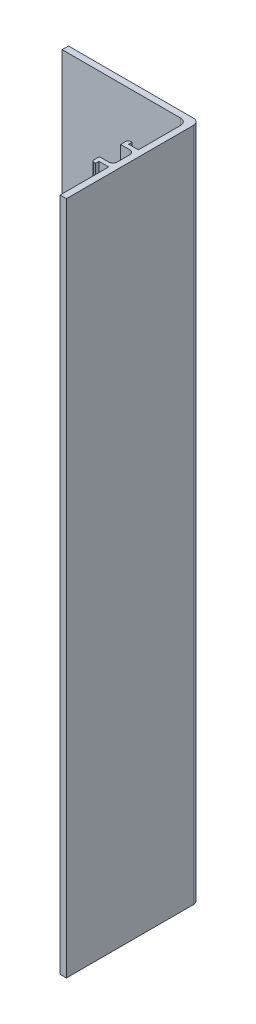
ISO-10303-21;
HEADER;
FILE_DESCRIPTION(('STEP AP214'),'2;1');
FILE_NAME('part.step','',(''),(''),'','','');
FILE_SCHEMA(('AUTOMOTIVE_DESIGN { 1 0 10303 214 1 1 1 1 }'));
ENDSEC;
DATA;
#1=APPLICATION_CONTEXT('core data for automotive mechanical design processes');
#2=APPLICATION_PROTOCOL_DEFINITION('international standard','automotive_design',2000,#1);
#3=PRODUCT_CONTEXT('',#1,'mechanical');
#4=PRODUCT('Part','Part','',(#3));
#5=PRODUCT_RELATED_PRODUCT_CATEGORY('part','',(#4));
#6=PRODUCT_DEFINITION_FORMATION('','',#4);
#7=PRODUCT_DEFINITION_CONTEXT('part definition',#1,'design');
#8=PRODUCT_DEFINITION('design','',#6,#7);
#9=PRODUCT_DEFINITION_SHAPE('','',#8);
#10=(LENGTH_UNIT() NAMED_UNIT(*) SI_UNIT(.MILLI.,.METRE.));
#11=(NAMED_UNIT(*) PLANE_ANGLE_UNIT() SI_UNIT($,.RADIAN.));
#12=(NAMED_UNIT(*) SI_UNIT($,.STERADIAN.) SOLID_ANGLE_UNIT());
#13=UNCERTAINTY_MEASURE_WITH_UNIT(LENGTH_MEASURE(1.E-05),#10,'distance_accuracy_value','');
#14=(GEOMETRIC_REPRESENTATION_CONTEXT(3) GLOBAL_UNCERTAINTY_ASSIGNED_CONTEXT((#13)) GLOBAL_UNIT_ASSIGNED_CONTEXT((#10,
#11,#12)) REPRESENTATION_CONTEXT('',''));
#15=CARTESIAN_POINT('',(0.,0.,0.));
#16=DIRECTION('',(0.,0.,1.));
#17=DIRECTION('',(1.,0.,0.));
#18=AXIS2_PLACEMENT_3D('',#15,#16,#17);
#19=CARTESIAN_POINT('',(-1.5,159.5,0.));
#20=DIRECTION('',(0.,0.,-1.));
#21=DIRECTION('',(-1.,0.,0.));
#22=AXIS2_PLACEMENT_3D('',#19,#20,#21);
#23=PLANE('',#22);
#24=DIRECTION('',(1.,0.,0.));
#25=VECTOR('',#24,1.);
#26=CARTESIAN_POINT('',(-1.5,0.,0.));
#27=LINE('',#26,#25);
#28=CARTESIAN_POINT('',(-1.5,0.,0.));
#29=VERTEX_POINT('',#28);
#30=CARTESIAN_POINT('',(0.,0.,0.));
#31=VERTEX_POINT('',#30);
#32=EDGE_CURVE('E220',#29,#31,#27,.T.);
#33=ORIENTED_EDGE('',*,*,#32,.T.);
#34=DIRECTION('',(0.,-1.,0.));
#35=VECTOR('',#34,1.);
#36=CARTESIAN_POINT('',(0.,159.5,0.));
#37=LINE('',#36,#35);
#38=CARTESIAN_POINT('',(0.,159.5,0.));
#39=VERTEX_POINT('',#38);
#40=EDGE_CURVE('E201',#39,#31,#37,.T.);
#41=ORIENTED_EDGE('',*,*,#40,.F.);
#42=DIRECTION('',(1.,0.,0.));
#43=VECTOR('',#42,1.);
#44=CARTESIAN_POINT('',(-1.5,159.5,0.));
#45=LINE('',#44,#43);
#46=CARTESIAN_POINT('',(-1.5,159.5,0.));
#47=VERTEX_POINT('',#46);
#48=EDGE_CURVE('E207',#47,#39,#45,.T.);
#49=ORIENTED_EDGE('',*,*,#48,.F.);
#50=DIRECTION('',(0.,-1.,0.));
#51=VECTOR('',#50,1.);
#52=CARTESIAN_POINT('',(-1.5,159.5,0.));
#53=LINE('',#52,#51);
#54=EDGE_CURVE('E367',#47,#29,#53,.T.);
#55=ORIENTED_EDGE('',*,*,#54,.T.);
#56=EDGE_LOOP('',(#33,#41,#49,#55));
#57=FACE_BOUND('',#56,.T.);
#58=ADVANCED_FACE('F39',(#57),#23,.F.);
#59=CARTESIAN_POINT('',(0.,159.5,0.));
#60=DIRECTION('',(-1.,0.,0.));
#61=DIRECTION('',(0.,0.,1.));
#62=AXIS2_PLACEMENT_3D('',#59,#60,#61);
#63=PLANE('',#62);
#64=DIRECTION('',(0.,0.,-1.));
#65=VECTOR('',#64,1.);
#66=CARTESIAN_POINT('',(0.,0.,0.));
#67=LINE('',#66,#65);
#68=CARTESIAN_POINT('',(0.,0.,-30.));
#69=VERTEX_POINT('',#68);
#70=EDGE_CURVE('E313',#31,#69,#67,.T.);
#71=ORIENTED_EDGE('',*,*,#70,.T.);
#72=DIRECTION('',(0.,-1.,0.));
#73=VECTOR('',#72,1.);
#74=CARTESIAN_POINT('',(0.,159.5,-30.));
#75=LINE('',#74,#73);
#76=CARTESIAN_POINT('',(0.,159.5,-30.));
#77=VERTEX_POINT('',#76);
#78=EDGE_CURVE('E48',#69,#77,#75,.F.);
#79=ORIENTED_EDGE('',*,*,#78,.T.);
#80=DIRECTION('',(0.,0.,-1.));
#81=VECTOR('',#80,1.);
#82=CARTESIAN_POINT('',(0.,159.5,0.));
#83=LINE('',#82,#81);
#84=EDGE_CURVE('E197',#39,#77,#83,.T.);
#85=ORIENTED_EDGE('',*,*,#84,.F.);
#86=ORIENTED_EDGE('',*,*,#40,.T.);
#87=EDGE_LOOP('',(#71,#79,#85,#86));
#88=FACE_BOUND('',#87,.T.);
#89=ADVANCED_FACE('F199',(#88),#63,.F.);
#90=CARTESIAN_POINT('',(0.,159.5,-31.5));
#91=DIRECTION('',(0.,0.,1.));
#92=DIRECTION('',(1.,0.,0.));
#93=AXIS2_PLACEMENT_3D('',#90,#91,#92);
#94=PLANE('',#93);
#95=DIRECTION('',(-1.,0.,0.));
#96=VECTOR('',#95,1.);
#97=CARTESIAN_POINT('',(0.,159.5,-31.5));
#98=LINE('',#97,#96);
#99=CARTESIAN_POINT('',(-1.5,159.5,-31.5));
#100=VERTEX_POINT('',#99);
#101=CARTESIAN_POINT('',(-31.,159.5,-31.5));
#102=VERTEX_POINT('',#101);
#103=EDGE_CURVE('E206',#100,#102,#98,.T.);
#104=ORIENTED_EDGE('',*,*,#103,.F.);
#105=DIRECTION('',(0.,-1.,0.));
#106=VECTOR('',#105,1.);
#107=CARTESIAN_POINT('',(-1.5,159.5,-31.5));
#108=LINE('',#107,#106);
#109=CARTESIAN_POINT('',(-1.5,0.,-31.5));
#110=VERTEX_POINT('',#109);
#111=EDGE_CURVE('E295',#100,#110,#108,.T.);
#112=ORIENTED_EDGE('',*,*,#111,.T.);
#113=DIRECTION('',(-1.,0.,0.));
#114=VECTOR('',#113,1.);
#115=CARTESIAN_POINT('',(0.,0.,-31.5));
#116=LINE('',#115,#114);
#117=CARTESIAN_POINT('',(-31.,0.,-31.5));
#118=VERTEX_POINT('',#117);
#119=EDGE_CURVE('E306',#110,#118,#116,.T.);
#120=ORIENTED_EDGE('',*,*,#119,.T.);
#121=DIRECTION('',(0.,-1.,0.));
#122=VECTOR('',#121,1.);
#123=CARTESIAN_POINT('',(-31.,159.5,-31.5));
#124=LINE('',#123,#122);
#125=EDGE_CURVE('E223',#102,#118,#124,.T.);
#126=ORIENTED_EDGE('',*,*,#125,.F.);
#127=EDGE_LOOP('',(#104,#112,#120,#126));
#128=FACE_BOUND('',#127,.T.);
#129=ADVANCED_FACE('F304',(#128),#94,.F.);
#130=CARTESIAN_POINT('',(-31.,159.5,-31.5));
#131=DIRECTION('',(1.,0.,0.));
#132=DIRECTION('',(0.,0.,-1.));
#133=AXIS2_PLACEMENT_3D('',#130,#131,#132);
#134=PLANE('',#133);
#135=DIRECTION('',(0.,0.,1.));
#136=VECTOR('',#135,1.);
#137=CARTESIAN_POINT('',(-31.,0.,-31.5));
#138=LINE('',#137,#136);
#139=CARTESIAN_POINT('',(-31.,0.,-30.));
#140=VERTEX_POINT('',#139);
#141=EDGE_CURVE('E311',#118,#140,#138,.T.);
#142=ORIENTED_EDGE('',*,*,#141,.T.);
#143=DIRECTION('',(0.,-1.,0.));
#144=VECTOR('',#143,1.);
#145=CARTESIAN_POINT('',(-31.,159.5,-30.));
#146=LINE('',#145,#144);
#147=CARTESIAN_POINT('',(-31.,159.5,-30.));
#148=VERTEX_POINT('',#147);
#149=EDGE_CURVE('E231',#148,#140,#146,.T.);
#150=ORIENTED_EDGE('',*,*,#149,.F.);
#151=DIRECTION('',(0.,0.,1.));
#152=VECTOR('',#151,1.);
#153=CARTESIAN_POINT('',(-31.,159.5,-31.5));
#154=LINE('',#153,#152);
#155=EDGE_CURVE('E431',#102,#148,#154,.T.);
#156=ORIENTED_EDGE('',*,*,#155,.F.);
#157=ORIENTED_EDGE('',*,*,#125,.T.);
#158=EDGE_LOOP('',(#142,#150,#156,#157));
#159=FACE_BOUND('',#158,.T.);
#160=ADVANCED_FACE('F482',(#159),#134,.F.);
#161=CARTESIAN_POINT('',(-31.,159.5,-30.));
#162=DIRECTION('',(0.,0.,-1.));
#163=DIRECTION('',(-1.,0.,0.));
#164=AXIS2_PLACEMENT_3D('',#161,#162,#163);
#165=PLANE('',#164);
#166=DIRECTION('',(1.,0.,0.));
#167=VECTOR('',#166,1.);
#168=CARTESIAN_POINT('',(-31.,0.,-30.));
#169=LINE('',#168,#167);
#170=CARTESIAN_POINT('',(-3.,0.,-30.));
#171=VERTEX_POINT('',#170);
#172=EDGE_CURVE('E317',#140,#171,#169,.T.);
#173=ORIENTED_EDGE('',*,*,#172,.T.);
#174=DIRECTION('',(0.,-1.,0.));
#175=VECTOR('',#174,1.);
#176=CARTESIAN_POINT('',(-3.,159.5,-30.));
#177=LINE('',#176,#175);
#178=CARTESIAN_POINT('',(-3.,159.5,-30.));
#179=VERTEX_POINT('',#178);
#180=EDGE_CURVE('E286',#171,#179,#177,.F.);
#181=ORIENTED_EDGE('',*,*,#180,.T.);
#182=DIRECTION('',(1.,0.,0.));
#183=VECTOR('',#182,1.);
#184=CARTESIAN_POINT('',(-31.,159.5,-30.));
#185=LINE('',#184,#183);
#186=EDGE_CURVE('E409',#148,#179,#185,.T.);
#187=ORIENTED_EDGE('',*,*,#186,.F.);
#188=ORIENTED_EDGE('',*,*,#149,.T.);
#189=EDGE_LOOP('',(#173,#181,#187,#188));
#190=FACE_BOUND('',#189,.T.);
#191=ADVANCED_FACE('F406',(#190),#165,.F.);
#192=CARTESIAN_POINT('',(-1.5,159.5,-30.));
#193=DIRECTION('',(1.,0.,0.));
#194=DIRECTION('',(0.,0.,-1.));
#195=AXIS2_PLACEMENT_3D('',#192,#193,#194);
#196=PLANE('',#195);
#197=DIRECTION('',(0.,0.,1.));
#198=VECTOR('',#197,1.);
#199=CARTESIAN_POINT('',(-1.5,159.5,-30.));
#200=LINE('',#199,#198);
#201=CARTESIAN_POINT('',(-1.5,159.5,-28.5));
#202=VERTEX_POINT('',#201);
#203=CARTESIAN_POINT('',(-1.5,159.5,-18.5));
#204=VERTEX_POINT('',#203);
#205=EDGE_CURVE('E422',#202,#204,#200,.T.);
#206=ORIENTED_EDGE('',*,*,#205,.F.);
#207=DIRECTION('',(0.,-1.,0.));
#208=VECTOR('',#207,1.);
#209=CARTESIAN_POINT('',(-1.5,0.,-28.5));
#210=LINE('',#209,#208);
#211=CARTESIAN_POINT('',(-1.5,0.,-28.5));
#212=VERTEX_POINT('',#211);
#213=EDGE_CURVE('E282',#202,#212,#210,.T.);
#214=ORIENTED_EDGE('',*,*,#213,.T.);
#215=DIRECTION('',(0.,0.,1.));
#216=VECTOR('',#215,1.);
#217=CARTESIAN_POINT('',(-1.5,0.,-30.));
#218=LINE('',#217,#216);
#219=CARTESIAN_POINT('',(-1.5,0.,-18.5));
#220=VERTEX_POINT('',#219);
#221=EDGE_CURVE('E325',#212,#220,#218,.T.);
#222=ORIENTED_EDGE('',*,*,#221,.T.);
#223=DIRECTION('',(0.,-1.,0.));
#224=VECTOR('',#223,1.);
#225=CARTESIAN_POINT('',(-1.5,159.5,-18.5));
#226=LINE('',#225,#224);
#227=EDGE_CURVE('E398',#204,#220,#226,.T.);
#228=ORIENTED_EDGE('',*,*,#227,.F.);
#229=EDGE_LOOP('',(#206,#214,#222,#228));
#230=FACE_BOUND('',#229,.T.);
#231=ADVANCED_FACE('F420',(#230),#196,.F.);
#232=CARTESIAN_POINT('',(-1.5,159.5,-18.5));
#233=DIRECTION('',(0.,0.,1.));
#234=DIRECTION('',(1.,0.,0.));
#235=AXIS2_PLACEMENT_3D('',#232,#233,#234);
#236=PLANE('',#235);
#237=DIRECTION('',(-1.,0.,0.));
#238=VECTOR('',#237,1.);
#239=CARTESIAN_POINT('',(-1.5,0.,-18.5));
#240=LINE('',#239,#238);
#241=CARTESIAN_POINT('',(-3.8,0.,-18.5));
#242=VERTEX_POINT('',#241);
#243=EDGE_CURVE('E328',#220,#242,#240,.T.);
#244=ORIENTED_EDGE('',*,*,#243,.T.);
#245=DIRECTION('',(0.,-1.,0.));
#246=VECTOR('',#245,1.);
#247=CARTESIAN_POINT('',(-3.8,159.5,-18.5));
#248=LINE('',#247,#246);
#249=CARTESIAN_POINT('',(-3.8,159.5,-18.5));
#250=VERTEX_POINT('',#249);
#251=EDGE_CURVE('E394',#250,#242,#248,.T.);
#252=ORIENTED_EDGE('',*,*,#251,.F.);
#253=DIRECTION('',(-1.,0.,0.));
#254=VECTOR('',#253,1.);
#255=CARTESIAN_POINT('',(-1.5,159.5,-18.5));
#256=LINE('',#255,#254);
#257=EDGE_CURVE('E425',#204,#250,#256,.T.);
#258=ORIENTED_EDGE('',*,*,#257,.F.);
#259=ORIENTED_EDGE('',*,*,#227,.T.);
#260=EDGE_LOOP('',(#244,#252,#258,#259));
#261=FACE_BOUND('',#260,.T.);
#262=ADVANCED_FACE('F567',(#261),#236,.F.);
#263=CARTESIAN_POINT('',(-3.8,159.5,-18.5));
#264=DIRECTION('',(-1.,0.,0.));
#265=DIRECTION('',(0.,0.,1.));
#266=AXIS2_PLACEMENT_3D('',#263,#264,#265);
#267=PLANE('',#266);
#268=DIRECTION('',(0.,0.,-1.));
#269=VECTOR('',#268,1.);
#270=CARTESIAN_POINT('',(-3.8,0.,-18.5));
#271=LINE('',#270,#269);
#272=CARTESIAN_POINT('',(-3.8,0.,-19.3));
#273=VERTEX_POINT('',#272);
#274=EDGE_CURVE('E331',#242,#273,#271,.T.);
#275=ORIENTED_EDGE('',*,*,#274,.T.);
#276=DIRECTION('',(0.,-1.,0.));
#277=VECTOR('',#276,1.);
#278=CARTESIAN_POINT('',(-3.8,159.5,-19.3));
#279=LINE('',#278,#277);
#280=CARTESIAN_POINT('',(-3.8,159.5,-19.3));
#281=VERTEX_POINT('',#280);
#282=EDGE_CURVE('E390',#281,#273,#279,.T.);
#283=ORIENTED_EDGE('',*,*,#282,.F.);
#284=DIRECTION('',(0.,0.,-1.));
#285=VECTOR('',#284,1.);
#286=CARTESIAN_POINT('',(-3.8,159.5,-18.5));
#287=LINE('',#286,#285);
#288=EDGE_CURVE('E429',#250,#281,#287,.T.);
#289=ORIENTED_EDGE('',*,*,#288,.F.);
#290=ORIENTED_EDGE('',*,*,#251,.T.);
#291=EDGE_LOOP('',(#275,#283,#289,#290));
#292=FACE_BOUND('',#291,.T.);
#293=ADVANCED_FACE('F670',(#292),#267,.F.);
#294=CARTESIAN_POINT('',(-4.7,159.5,-19.3));
#295=DIRECTION('',(0.,0.,1.));
#296=DIRECTION('',(1.,0.,0.));
#297=AXIS2_PLACEMENT_3D('',#294,#295,#296);
#298=PLANE('',#297);
#299=DIRECTION('',(-1.,0.,0.));
#300=VECTOR('',#299,1.);
#301=CARTESIAN_POINT('',(-4.7,0.,-19.3));
#302=LINE('',#301,#300);
#303=CARTESIAN_POINT('',(-4.2,0.,-19.3));
#304=VERTEX_POINT('',#303);
#305=EDGE_CURVE('E334',#273,#304,#302,.T.);
#306=ORIENTED_EDGE('',*,*,#305,.T.);
#307=DIRECTION('',(0.,-1.,0.));
#308=VECTOR('',#307,1.);
#309=CARTESIAN_POINT('',(-4.2,159.5,-19.3));
#310=LINE('',#309,#308);
#311=CARTESIAN_POINT('',(-4.2,159.5,-19.3));
#312=VERTEX_POINT('',#311);
#313=EDGE_CURVE('E253',#304,#312,#310,.F.);
#314=ORIENTED_EDGE('',*,*,#313,.T.);
#315=DIRECTION('',(-1.,0.,0.));
#316=VECTOR('',#315,1.);
#317=CARTESIAN_POINT('',(-4.7,159.5,-19.3));
#318=LINE('',#317,#316);
#319=EDGE_CURVE('E437',#281,#312,#318,.T.);
#320=ORIENTED_EDGE('',*,*,#319,.F.);
#321=ORIENTED_EDGE('',*,*,#282,.T.);
#322=EDGE_LOOP('',(#306,#314,#320,#321));
#323=FACE_BOUND('',#322,.T.);
#324=ADVANCED_FACE('F660',(#323),#298,.F.);
#325=CARTESIAN_POINT('',(-4.7,159.5,-19.3));
#326=DIRECTION('',(1.,0.,0.));
#327=DIRECTION('',(0.,0.,-1.));
#328=AXIS2_PLACEMENT_3D('',#325,#326,#327);
#329=PLANE('',#328);
#330=DIRECTION('',(0.,0.,1.));
#331=VECTOR('',#330,1.);
#332=CARTESIAN_POINT('',(-4.7,159.5,-19.3));
#333=LINE('',#332,#331);
#334=CARTESIAN_POINT('',(-4.7,159.5,-18.8));
#335=VERTEX_POINT('',#334);
#336=CARTESIAN_POINT('',(-4.7,159.5,-17.5));
#337=VERTEX_POINT('',#336);
#338=EDGE_CURVE('E441',#335,#337,#333,.T.);
#339=ORIENTED_EDGE('',*,*,#338,.F.);
#340=DIRECTION('',(0.,-1.,0.));
#341=VECTOR('',#340,1.);
#342=CARTESIAN_POINT('',(-4.7,159.5,-18.8));
#343=LINE('',#342,#341);
#344=CARTESIAN_POINT('',(-4.7,0.,-18.8));
#345=VERTEX_POINT('',#344);
#346=EDGE_CURVE('E249',#335,#345,#343,.T.);
#347=ORIENTED_EDGE('',*,*,#346,.T.);
#348=DIRECTION('',(0.,0.,1.));
#349=VECTOR('',#348,1.);
#350=CARTESIAN_POINT('',(-4.7,0.,-19.3));
#351=LINE('',#350,#349);
#352=CARTESIAN_POINT('',(-4.7,0.,-17.5));
#353=VERTEX_POINT('',#352);
#354=EDGE_CURVE('E338',#345,#353,#351,.T.);
#355=ORIENTED_EDGE('',*,*,#354,.T.);
#356=DIRECTION('',(0.,-1.,0.));
#357=VECTOR('',#356,1.);
#358=CARTESIAN_POINT('',(-4.7,159.5,-17.5));
#359=LINE('',#358,#357);
#360=EDGE_CURVE('E386',#337,#353,#359,.T.);
#361=ORIENTED_EDGE('',*,*,#360,.F.);
#362=EDGE_LOOP('',(#339,#347,#355,#361));
#363=FACE_BOUND('',#362,.T.);
#364=ADVANCED_FACE('F620',(#363),#329,.F.);
#365=CARTESIAN_POINT('',(-4.7,159.5,-17.5));
#366=DIRECTION('',(0.,0.,-1.));
#367=DIRECTION('',(-1.,0.,0.));
#368=AXIS2_PLACEMENT_3D('',#365,#366,#367);
#369=PLANE('',#368);
#370=DIRECTION('',(1.,0.,0.));
#371=VECTOR('',#370,1.);
#372=CARTESIAN_POINT('',(-4.7,0.,-17.5));
#373=LINE('',#372,#371);
#374=CARTESIAN_POINT('',(-2.5,0.,-17.5));
#375=VERTEX_POINT('',#374);
#376=EDGE_CURVE('E341',#353,#375,#373,.T.);
#377=ORIENTED_EDGE('',*,*,#376,.T.);
#378=DIRECTION('',(0.,-1.,0.));
#379=VECTOR('',#378,1.);
#380=CARTESIAN_POINT('',(-2.5,159.5,-17.5));
#381=LINE('',#380,#379);
#382=CARTESIAN_POINT('',(-2.5,159.5,-17.5));
#383=VERTEX_POINT('',#382);
#384=EDGE_CURVE('E267',#375,#383,#381,.F.);
#385=ORIENTED_EDGE('',*,*,#384,.T.);
#386=DIRECTION('',(1.,0.,0.));
#387=VECTOR('',#386,1.);
#388=CARTESIAN_POINT('',(-4.7,159.5,-17.5));
#389=LINE('',#388,#387);
#390=EDGE_CURVE('E444',#337,#383,#389,.T.);
#391=ORIENTED_EDGE('',*,*,#390,.F.);
#392=ORIENTED_EDGE('',*,*,#360,.T.);
#393=EDGE_LOOP('',(#377,#385,#391,#392));
#394=FACE_BOUND('',#393,.T.);
#395=ADVANCED_FACE('F610',(#394),#369,.F.);
#396=CARTESIAN_POINT('',(-1.5,159.5,-17.5));
#397=DIRECTION('',(1.,0.,0.));
#398=DIRECTION('',(0.,0.,-1.));
#399=AXIS2_PLACEMENT_3D('',#396,#397,#398);
#400=PLANE('',#399);
#401=DIRECTION('',(0.,0.,1.));
#402=VECTOR('',#401,1.);
#403=CARTESIAN_POINT('',(-1.5,0.,-17.5));
#404=LINE('',#403,#402);
#405=CARTESIAN_POINT('',(-1.5,0.,-16.5));
#406=VERTEX_POINT('',#405);
#407=CARTESIAN_POINT('',(-1.5,0.,-13.5));
#408=VERTEX_POINT('',#407);
#409=EDGE_CURVE('E345',#406,#408,#404,.T.);
#410=ORIENTED_EDGE('',*,*,#409,.T.);
#411=DIRECTION('',(0.,-1.,0.));
#412=VECTOR('',#411,1.);
#413=CARTESIAN_POINT('',(-1.5,159.5,-13.5));
#414=LINE('',#413,#412);
#415=CARTESIAN_POINT('',(-1.5,159.5,-13.5));
#416=VERTEX_POINT('',#415);
#417=EDGE_CURVE('E264',#408,#416,#414,.F.);
#418=ORIENTED_EDGE('',*,*,#417,.T.);
#419=DIRECTION('',(0.,0.,1.));
#420=VECTOR('',#419,1.);
#421=CARTESIAN_POINT('',(-1.5,159.5,-17.5));
#422=LINE('',#421,#420);
#423=CARTESIAN_POINT('',(-1.5,159.5,-16.5));
#424=VERTEX_POINT('',#423);
#425=EDGE_CURVE('E448',#424,#416,#422,.T.);
#426=ORIENTED_EDGE('',*,*,#425,.F.);
#427=DIRECTION('',(0.,-1.,0.));
#428=VECTOR('',#427,1.);
#429=CARTESIAN_POINT('',(-1.5,0.,-16.5));
#430=LINE('',#429,#428);
#431=EDGE_CURVE('E260',#424,#406,#430,.T.);
#432=ORIENTED_EDGE('',*,*,#431,.T.);
#433=EDGE_LOOP('',(#410,#418,#426,#432));
#434=FACE_BOUND('',#433,.T.);
#435=ADVANCED_FACE('F598',(#434),#400,.F.);
#436=CARTESIAN_POINT('',(-1.5,159.5,-12.5));
#437=DIRECTION('',(0.,0.,1.));
#438=DIRECTION('',(1.,0.,0.));
#439=AXIS2_PLACEMENT_3D('',#436,#437,#438);
#440=PLANE('',#439);
#441=DIRECTION('',(-1.,0.,0.));
#442=VECTOR('',#441,1.);
#443=CARTESIAN_POINT('',(-1.5,159.5,-12.5));
#444=LINE('',#443,#442);
#445=CARTESIAN_POINT('',(-2.5,159.5,-12.5));
#446=VERTEX_POINT('',#445);
#447=CARTESIAN_POINT('',(-4.7,159.5,-12.5));
#448=VERTEX_POINT('',#447);
#449=EDGE_CURVE('E452',#446,#448,#444,.T.);
#450=ORIENTED_EDGE('',*,*,#449,.F.);
#451=DIRECTION('',(0.,-1.,0.));
#452=VECTOR('',#451,1.);
#453=CARTESIAN_POINT('',(-2.5,0.,-12.5));
#454=LINE('',#453,#452);
#455=CARTESIAN_POINT('',(-2.5,0.,-12.5));
#456=VERTEX_POINT('',#455);
#457=EDGE_CURVE('E256',#446,#456,#454,.T.);
#458=ORIENTED_EDGE('',*,*,#457,.T.);
#459=DIRECTION('',(-1.,0.,0.));
#460=VECTOR('',#459,1.);
#461=CARTESIAN_POINT('',(-1.5,0.,-12.5));
#462=LINE('',#461,#460);
#463=CARTESIAN_POINT('',(-4.7,0.,-12.5));
#464=VERTEX_POINT('',#463);
#465=EDGE_CURVE('E349',#456,#464,#462,.T.);
#466=ORIENTED_EDGE('',*,*,#465,.T.);
#467=DIRECTION('',(0.,-1.,0.));
#468=VECTOR('',#467,1.);
#469=CARTESIAN_POINT('',(-4.7,159.5,-12.5));
#470=LINE('',#469,#468);
#471=EDGE_CURVE('E382',#448,#464,#470,.T.);
#472=ORIENTED_EDGE('',*,*,#471,.F.);
#473=EDGE_LOOP('',(#450,#458,#466,#472));
#474=FACE_BOUND('',#473,.T.);
#475=ADVANCED_FACE('F592',(#474),#440,.F.);
#476=CARTESIAN_POINT('',(-4.7,159.5,-12.5));
#477=DIRECTION('',(1.,0.,0.));
#478=DIRECTION('',(0.,0.,-1.));
#479=AXIS2_PLACEMENT_3D('',#476,#477,#478);
#480=PLANE('',#479);
#481=DIRECTION('',(0.,0.,1.));
#482=VECTOR('',#481,1.);
#483=CARTESIAN_POINT('',(-4.7,0.,-12.5));
#484=LINE('',#483,#482);
#485=CARTESIAN_POINT('',(-4.7,0.,-11.2));
#486=VERTEX_POINT('',#485);
#487=EDGE_CURVE('E352',#464,#486,#484,.T.);
#488=ORIENTED_EDGE('',*,*,#487,.T.);
#489=DIRECTION('',(0.,-1.,0.));
#490=VECTOR('',#489,1.);
#491=CARTESIAN_POINT('',(-4.7,159.5,-11.2));
#492=LINE('',#491,#490);
#493=CARTESIAN_POINT('',(-4.7,159.5,-11.2));
#494=VERTEX_POINT('',#493);
#495=EDGE_CURVE('E240',#486,#494,#492,.F.);
#496=ORIENTED_EDGE('',*,*,#495,.T.);
#497=DIRECTION('',(0.,0.,1.));
#498=VECTOR('',#497,1.);
#499=CARTESIAN_POINT('',(-4.7,159.5,-12.5));
#500=LINE('',#499,#498);
#501=EDGE_CURVE('E455',#448,#494,#500,.T.);
#502=ORIENTED_EDGE('',*,*,#501,.F.);
#503=ORIENTED_EDGE('',*,*,#471,.T.);
#504=EDGE_LOOP('',(#488,#496,#502,#503));
#505=FACE_BOUND('',#504,.T.);
#506=ADVANCED_FACE('F597',(#505),#480,.F.);
#507=CARTESIAN_POINT('',(-4.7,159.5,-10.7));
#508=DIRECTION('',(0.,0.,-1.));
#509=DIRECTION('',(-1.,0.,0.));
#510=AXIS2_PLACEMENT_3D('',#507,#508,#509);
#511=PLANE('',#510);
#512=DIRECTION('',(1.,0.,0.));
#513=VECTOR('',#512,1.);
#514=CARTESIAN_POINT('',(-4.7,159.5,-10.7));
#515=LINE('',#514,#513);
#516=CARTESIAN_POINT('',(-4.2,159.5,-10.7));
#517=VERTEX_POINT('',#516);
#518=CARTESIAN_POINT('',(-3.8,159.5,-10.7));
#519=VERTEX_POINT('',#518);
#520=EDGE_CURVE('E459',#517,#519,#515,.T.);
#521=ORIENTED_EDGE('',*,*,#520,.F.);
#522=DIRECTION('',(0.,-1.,0.));
#523=VECTOR('',#522,1.);
#524=CARTESIAN_POINT('',(-4.2,159.5,-10.7));
#525=LINE('',#524,#523);
#526=CARTESIAN_POINT('',(-4.2,0.,-10.7));
#527=VERTEX_POINT('',#526);
#528=EDGE_CURVE('E222',#517,#527,#525,.T.);
#529=ORIENTED_EDGE('',*,*,#528,.T.);
#530=DIRECTION('',(1.,0.,0.));
#531=VECTOR('',#530,1.);
#532=CARTESIAN_POINT('',(-4.7,0.,-10.7));
#533=LINE('',#532,#531);
#534=CARTESIAN_POINT('',(-3.8,0.,-10.7));
#535=VERTEX_POINT('',#534);
#536=EDGE_CURVE('E356',#527,#535,#533,.T.);
#537=ORIENTED_EDGE('',*,*,#536,.T.);
#538=DIRECTION('',(0.,-1.,0.));
#539=VECTOR('',#538,1.);
#540=CARTESIAN_POINT('',(-3.8,159.5,-10.7));
#541=LINE('',#540,#539);
#542=EDGE_CURVE('E378',#519,#535,#541,.T.);
#543=ORIENTED_EDGE('',*,*,#542,.F.);
#544=EDGE_LOOP('',(#521,#529,#537,#543));
#545=FACE_BOUND('',#544,.T.);
#546=ADVANCED_FACE('F638',(#545),#511,.F.);
#547=CARTESIAN_POINT('',(-3.8,159.5,-11.5));
#548=DIRECTION('',(-1.,0.,0.));
#549=DIRECTION('',(0.,0.,1.));
#550=AXIS2_PLACEMENT_3D('',#547,#548,#549);
#551=PLANE('',#550);
#552=DIRECTION('',(0.,0.,-1.));
#553=VECTOR('',#552,1.);
#554=CARTESIAN_POINT('',(-3.8,0.,-11.5));
#555=LINE('',#554,#553);
#556=CARTESIAN_POINT('',(-3.8,0.,-11.5));
#557=VERTEX_POINT('',#556);
#558=EDGE_CURVE('E359',#535,#557,#555,.T.);
#559=ORIENTED_EDGE('',*,*,#558,.T.);
#560=DIRECTION('',(0.,-1.,0.));
#561=VECTOR('',#560,1.);
#562=CARTESIAN_POINT('',(-3.8,159.5,-11.5));
#563=LINE('',#562,#561);
#564=CARTESIAN_POINT('',(-3.8,159.5,-11.5));
#565=VERTEX_POINT('',#564);
#566=EDGE_CURVE('E374',#565,#557,#563,.T.);
#567=ORIENTED_EDGE('',*,*,#566,.F.);
#568=DIRECTION('',(0.,0.,-1.));
#569=VECTOR('',#568,1.);
#570=CARTESIAN_POINT('',(-3.8,159.5,-11.5));
#571=LINE('',#570,#569);
#572=EDGE_CURVE('E462',#519,#565,#571,.T.);
#573=ORIENTED_EDGE('',*,*,#572,.F.);
#574=ORIENTED_EDGE('',*,*,#542,.T.);
#575=EDGE_LOOP('',(#559,#567,#573,#574));
#576=FACE_BOUND('',#575,.T.);
#577=ADVANCED_FACE('F643',(#576),#551,.F.);
#578=CARTESIAN_POINT('',(-3.8,159.5,-11.5));
#579=DIRECTION('',(0.,0.,-1.));
#580=DIRECTION('',(-1.,0.,0.));
#581=AXIS2_PLACEMENT_3D('',#578,#579,#580);
#582=PLANE('',#581);
#583=DIRECTION('',(1.,0.,0.));
#584=VECTOR('',#583,1.);
#585=CARTESIAN_POINT('',(-3.8,0.,-11.5));
#586=LINE('',#585,#584);
#587=CARTESIAN_POINT('',(-1.5,0.,-11.5));
#588=VERTEX_POINT('',#587);
#589=EDGE_CURVE('E362',#557,#588,#586,.T.);
#590=ORIENTED_EDGE('',*,*,#589,.T.);
#591=DIRECTION('',(0.,-1.,0.));
#592=VECTOR('',#591,1.);
#593=CARTESIAN_POINT('',(-1.5,159.5,-11.5));
#594=LINE('',#593,#592);
#595=CARTESIAN_POINT('',(-1.5,159.5,-11.5));
#596=VERTEX_POINT('',#595);
#597=EDGE_CURVE('E370',#596,#588,#594,.T.);
#598=ORIENTED_EDGE('',*,*,#597,.F.);
#599=DIRECTION('',(1.,0.,0.));
#600=VECTOR('',#599,1.);
#601=CARTESIAN_POINT('',(-3.8,159.5,-11.5));
#602=LINE('',#601,#600);
#603=EDGE_CURVE('E465',#565,#596,#602,.T.);
#604=ORIENTED_EDGE('',*,*,#603,.F.);
#605=ORIENTED_EDGE('',*,*,#566,.T.);
#606=EDGE_LOOP('',(#590,#598,#604,#605));
#607=FACE_BOUND('',#606,.T.);
#608=ADVANCED_FACE('F475',(#607),#582,.F.);
#609=CARTESIAN_POINT('',(-1.5,159.5,-11.5));
#610=DIRECTION('',(1.,0.,0.));
#611=DIRECTION('',(0.,0.,-1.));
#612=AXIS2_PLACEMENT_3D('',#609,#610,#611);
#613=PLANE('',#612);
#614=DIRECTION('',(0.,0.,1.));
#615=VECTOR('',#614,1.);
#616=CARTESIAN_POINT('',(-1.5,0.,-11.5));
#617=LINE('',#616,#615);
#618=EDGE_CURVE('E217',#588,#29,#617,.T.);
#619=ORIENTED_EDGE('',*,*,#618,.T.);
#620=ORIENTED_EDGE('',*,*,#54,.F.);
#621=DIRECTION('',(0.,0.,1.));
#622=VECTOR('',#621,1.);
#623=CARTESIAN_POINT('',(-1.5,159.5,-11.5));
#624=LINE('',#623,#622);
#625=EDGE_CURVE('E212',#596,#47,#624,.T.);
#626=ORIENTED_EDGE('',*,*,#625,.F.);
#627=ORIENTED_EDGE('',*,*,#597,.T.);
#628=EDGE_LOOP('',(#619,#620,#626,#627));
#629=FACE_BOUND('',#628,.T.);
#630=ADVANCED_FACE('F479',(#629),#613,.F.);
#631=CARTESIAN_POINT('',(0.,159.5,0.));
#632=DIRECTION('',(0.,1.,0.));
#633=DIRECTION('',(0.,0.,1.));
#634=AXIS2_PLACEMENT_3D('',#631,#632,#633);
#635=PLANE('',#634);
#636=ORIENTED_EDGE('',*,*,#84,.T.);
#637=CARTESIAN_POINT('',(-1.5,159.5,-30.));
#638=DIRECTION('',(0.,1.,0.));
#639=DIRECTION('',(0.,0.,1.));
#640=AXIS2_PLACEMENT_3D('',#637,#638,#639);
#641=CIRCLE('',#640,1.5);
#642=EDGE_CURVE('E11',#77,#100,#641,.T.);
#643=ORIENTED_EDGE('',*,*,#642,.T.);
#644=ORIENTED_EDGE('',*,*,#103,.T.);
#645=ORIENTED_EDGE('',*,*,#155,.T.);
#646=ORIENTED_EDGE('',*,*,#186,.T.);
#647=CARTESIAN_POINT('',(-3.,159.5,-28.5));
#648=DIRECTION('',(0.,1.,0.));
#649=DIRECTION('',(0.,0.,1.));
#650=AXIS2_PLACEMENT_3D('',#647,#648,#649);
#651=CIRCLE('',#650,1.5);
#652=EDGE_CURVE('E292',#179,#202,#651,.F.);
#653=ORIENTED_EDGE('',*,*,#652,.T.);
#654=ORIENTED_EDGE('',*,*,#205,.T.);
#655=ORIENTED_EDGE('',*,*,#257,.T.);
#656=ORIENTED_EDGE('',*,*,#288,.T.);
#657=ORIENTED_EDGE('',*,*,#319,.T.);
#658=CARTESIAN_POINT('',(-4.2,159.5,-18.8));
#659=DIRECTION('',(0.,1.,0.));
#660=DIRECTION('',(0.,0.,1.));
#661=AXIS2_PLACEMENT_3D('',#658,#659,#660);
#662=CIRCLE('',#661,0.5);
#663=EDGE_CURVE('E243',#312,#335,#662,.T.);
#664=ORIENTED_EDGE('',*,*,#663,.T.);
#665=ORIENTED_EDGE('',*,*,#338,.T.);
#666=ORIENTED_EDGE('',*,*,#390,.T.);
#667=CARTESIAN_POINT('',(-2.5,159.5,-16.5));
#668=DIRECTION('',(0.,1.,0.));
#669=DIRECTION('',(0.,0.,1.));
#670=AXIS2_PLACEMENT_3D('',#667,#668,#669);
#671=CIRCLE('',#670,1.);
#672=EDGE_CURVE('E279',#383,#424,#671,.F.);
#673=ORIENTED_EDGE('',*,*,#672,.T.);
#674=ORIENTED_EDGE('',*,*,#425,.T.);
#675=CARTESIAN_POINT('',(-2.5,159.5,-13.5));
#676=DIRECTION('',(0.,1.,0.));
#677=DIRECTION('',(0.,0.,1.));
#678=AXIS2_PLACEMENT_3D('',#675,#676,#677);
#679=CIRCLE('',#678,1.);
#680=EDGE_CURVE('E273',#416,#446,#679,.F.);
#681=ORIENTED_EDGE('',*,*,#680,.T.);
#682=ORIENTED_EDGE('',*,*,#449,.T.);
#683=ORIENTED_EDGE('',*,*,#501,.T.);
#684=CARTESIAN_POINT('',(-4.2,159.5,-11.2));
#685=DIRECTION('',(0.,1.,0.));
#686=DIRECTION('',(0.,0.,1.));
#687=AXIS2_PLACEMENT_3D('',#684,#685,#686);
#688=CIRCLE('',#687,0.5);
#689=EDGE_CURVE('E246',#494,#517,#688,.T.);
#690=ORIENTED_EDGE('',*,*,#689,.T.);
#691=ORIENTED_EDGE('',*,*,#520,.T.);
#692=ORIENTED_EDGE('',*,*,#572,.T.);
#693=ORIENTED_EDGE('',*,*,#603,.T.);
#694=ORIENTED_EDGE('',*,*,#625,.T.);
#695=ORIENTED_EDGE('',*,*,#48,.T.);
#696=EDGE_LOOP('',(#636,#643,#644,#645,#646,#653,#654,#655,#656,#657,#664,#665,#666,#673,#674,
#681,#682,#683,#690,#691,#692,#693,#694,#695));
#697=FACE_BOUND('',#696,.T.);
#698=ADVANCED_FACE('F210',(#697),#635,.T.);
#699=CARTESIAN_POINT('',(0.,0.,0.));
#700=DIRECTION('',(0.,1.,0.));
#701=DIRECTION('',(0.,0.,1.));
#702=AXIS2_PLACEMENT_3D('',#699,#700,#701);
#703=PLANE('',#702);
#704=ORIENTED_EDGE('',*,*,#119,.F.);
#705=CARTESIAN_POINT('',(-1.5,0.,-30.));
#706=DIRECTION('',(0.,1.,0.));
#707=DIRECTION('',(0.,0.,1.));
#708=AXIS2_PLACEMENT_3D('',#705,#706,#707);
#709=CIRCLE('',#708,1.5);
#710=EDGE_CURVE('E62',#110,#69,#709,.F.);
#711=ORIENTED_EDGE('',*,*,#710,.T.);
#712=ORIENTED_EDGE('',*,*,#70,.F.);
#713=ORIENTED_EDGE('',*,*,#32,.F.);
#714=ORIENTED_EDGE('',*,*,#618,.F.);
#715=ORIENTED_EDGE('',*,*,#589,.F.);
#716=ORIENTED_EDGE('',*,*,#558,.F.);
#717=ORIENTED_EDGE('',*,*,#536,.F.);
#718=CARTESIAN_POINT('',(-4.2,0.,-11.2));
#719=DIRECTION('',(0.,1.,0.));
#720=DIRECTION('',(0.,0.,1.));
#721=AXIS2_PLACEMENT_3D('',#718,#719,#720);
#722=CIRCLE('',#721,0.5);
#723=EDGE_CURVE('E237',#527,#486,#722,.F.);
#724=ORIENTED_EDGE('',*,*,#723,.T.);
#725=ORIENTED_EDGE('',*,*,#487,.F.);
#726=ORIENTED_EDGE('',*,*,#465,.F.);
#727=CARTESIAN_POINT('',(-2.5,0.,-13.5));
#728=DIRECTION('',(0.,1.,0.));
#729=DIRECTION('',(0.,0.,1.));
#730=AXIS2_PLACEMENT_3D('',#727,#728,#729);
#731=CIRCLE('',#730,1.);
#732=EDGE_CURVE('E270',#456,#408,#731,.T.);
#733=ORIENTED_EDGE('',*,*,#732,.T.);
#734=ORIENTED_EDGE('',*,*,#409,.F.);
#735=CARTESIAN_POINT('',(-2.5,0.,-16.5));
#736=DIRECTION('',(0.,1.,0.));
#737=DIRECTION('',(0.,0.,1.));
#738=AXIS2_PLACEMENT_3D('',#735,#736,#737);
#739=CIRCLE('',#738,1.);
#740=EDGE_CURVE('E276',#406,#375,#739,.T.);
#741=ORIENTED_EDGE('',*,*,#740,.T.);
#742=ORIENTED_EDGE('',*,*,#376,.F.);
#743=ORIENTED_EDGE('',*,*,#354,.F.);
#744=CARTESIAN_POINT('',(-4.2,0.,-18.8));
#745=DIRECTION('',(0.,1.,0.));
#746=DIRECTION('',(0.,0.,1.));
#747=AXIS2_PLACEMENT_3D('',#744,#745,#746);
#748=CIRCLE('',#747,0.5);
#749=EDGE_CURVE('E228',#345,#304,#748,.F.);
#750=ORIENTED_EDGE('',*,*,#749,.T.);
#751=ORIENTED_EDGE('',*,*,#305,.F.);
#752=ORIENTED_EDGE('',*,*,#274,.F.);
#753=ORIENTED_EDGE('',*,*,#243,.F.);
#754=ORIENTED_EDGE('',*,*,#221,.F.);
#755=CARTESIAN_POINT('',(-3.,0.,-28.5));
#756=DIRECTION('',(0.,1.,0.));
#757=DIRECTION('',(0.,0.,1.));
#758=AXIS2_PLACEMENT_3D('',#755,#756,#757);
#759=CIRCLE('',#758,1.5);
#760=EDGE_CURVE('E289',#212,#171,#759,.T.);
#761=ORIENTED_EDGE('',*,*,#760,.T.);
#762=ORIENTED_EDGE('',*,*,#172,.F.);
#763=ORIENTED_EDGE('',*,*,#141,.F.);
#764=EDGE_LOOP('',(#704,#711,#712,#713,#714,#715,#716,#717,#724,#725,#726,#733,#734,#741,#742,
#743,#750,#751,#752,#753,#754,#761,#762,#763));
#765=FACE_BOUND('',#764,.T.);
#766=ADVANCED_FACE('F309',(#765),#703,.F.);
#767=CARTESIAN_POINT('',(-4.2,159.5,-11.2));
#768=DIRECTION('',(0.,-1.,0.));
#769=DIRECTION('',(0.,0.,-1.));
#770=AXIS2_PLACEMENT_3D('',#767,#768,#769);
#771=CYLINDRICAL_SURFACE('',#770,0.5);
#772=ORIENTED_EDGE('',*,*,#689,.F.);
#773=ORIENTED_EDGE('',*,*,#495,.F.);
#774=ORIENTED_EDGE('',*,*,#723,.F.);
#775=ORIENTED_EDGE('',*,*,#528,.F.);
#776=EDGE_LOOP('',(#772,#773,#774,#775));
#777=FACE_BOUND('',#776,.T.);
#778=ADVANCED_FACE('F499',(#777),#771,.T.);
#779=CARTESIAN_POINT('',(-4.2,159.5,-18.8));
#780=DIRECTION('',(0.,-1.,0.));
#781=DIRECTION('',(0.,0.,-1.));
#782=AXIS2_PLACEMENT_3D('',#779,#780,#781);
#783=CYLINDRICAL_SURFACE('',#782,0.5);
#784=ORIENTED_EDGE('',*,*,#663,.F.);
#785=ORIENTED_EDGE('',*,*,#313,.F.);
#786=ORIENTED_EDGE('',*,*,#749,.F.);
#787=ORIENTED_EDGE('',*,*,#346,.F.);
#788=EDGE_LOOP('',(#784,#785,#786,#787));
#789=FACE_BOUND('',#788,.T.);
#790=ADVANCED_FACE('F502',(#789),#783,.T.);
#791=CARTESIAN_POINT('',(-2.5,159.5,-13.5));
#792=DIRECTION('',(0.,1.,0.));
#793=DIRECTION('',(0.,0.,1.));
#794=AXIS2_PLACEMENT_3D('',#791,#792,#793);
#795=CYLINDRICAL_SURFACE('',#794,1.);
#796=ORIENTED_EDGE('',*,*,#680,.F.);
#797=ORIENTED_EDGE('',*,*,#417,.F.);
#798=ORIENTED_EDGE('',*,*,#732,.F.);
#799=ORIENTED_EDGE('',*,*,#457,.F.);
#800=EDGE_LOOP('',(#796,#797,#798,#799));
#801=FACE_BOUND('',#800,.T.);
#802=ADVANCED_FACE('F506',(#801),#795,.F.);
#803=CARTESIAN_POINT('',(-2.5,159.5,-16.5));
#804=DIRECTION('',(0.,1.,0.));
#805=DIRECTION('',(0.,0.,1.));
#806=AXIS2_PLACEMENT_3D('',#803,#804,#805);
#807=CYLINDRICAL_SURFACE('',#806,1.);
#808=ORIENTED_EDGE('',*,*,#672,.F.);
#809=ORIENTED_EDGE('',*,*,#384,.F.);
#810=ORIENTED_EDGE('',*,*,#740,.F.);
#811=ORIENTED_EDGE('',*,*,#431,.F.);
#812=EDGE_LOOP('',(#808,#809,#810,#811));
#813=FACE_BOUND('',#812,.T.);
#814=ADVANCED_FACE('F510',(#813),#807,.F.);
#815=CARTESIAN_POINT('',(-3.,159.5,-28.5));
#816=DIRECTION('',(0.,1.,0.));
#817=DIRECTION('',(0.,0.,1.));
#818=AXIS2_PLACEMENT_3D('',#815,#816,#817);
#819=CYLINDRICAL_SURFACE('',#818,1.5);
#820=ORIENTED_EDGE('',*,*,#652,.F.);
#821=ORIENTED_EDGE('',*,*,#180,.F.);
#822=ORIENTED_EDGE('',*,*,#760,.F.);
#823=ORIENTED_EDGE('',*,*,#213,.F.);
#824=EDGE_LOOP('',(#820,#821,#822,#823));
#825=FACE_BOUND('',#824,.T.);
#826=ADVANCED_FACE('F417',(#825),#819,.F.);
#827=CARTESIAN_POINT('',(-1.5,159.5,-30.));
#828=DIRECTION('',(0.,-1.,0.));
#829=DIRECTION('',(0.,0.,-1.));
#830=AXIS2_PLACEMENT_3D('',#827,#828,#829);
#831=CYLINDRICAL_SURFACE('',#830,1.5);
#832=ORIENTED_EDGE('',*,*,#642,.F.);
#833=ORIENTED_EDGE('',*,*,#78,.F.);
#834=ORIENTED_EDGE('',*,*,#710,.F.);
#835=ORIENTED_EDGE('',*,*,#111,.F.);
#836=EDGE_LOOP('',(#832,#833,#834,#835));
#837=FACE_BOUND('',#836,.T.);
#838=ADVANCED_FACE('F41',(#837),#831,.T.);
#839=CLOSED_SHELL('',(#58,#89,#129,#160,#191,#231,#262,#293,#324,#364,#395,#435,#475,#506,#546,
#577,#608,#630,#698,#766,#778,#790,#802,#814,#826,#838));
#840=MANIFOLD_SOLID_BREP('B2',#839);
#841=ADVANCED_BREP_SHAPE_REPRESENTATION('',(#18,#840),#14);
#842=SHAPE_DEFINITION_REPRESENTATION(#9,#841);
ENDSEC;
END-ISO-10303-21;
